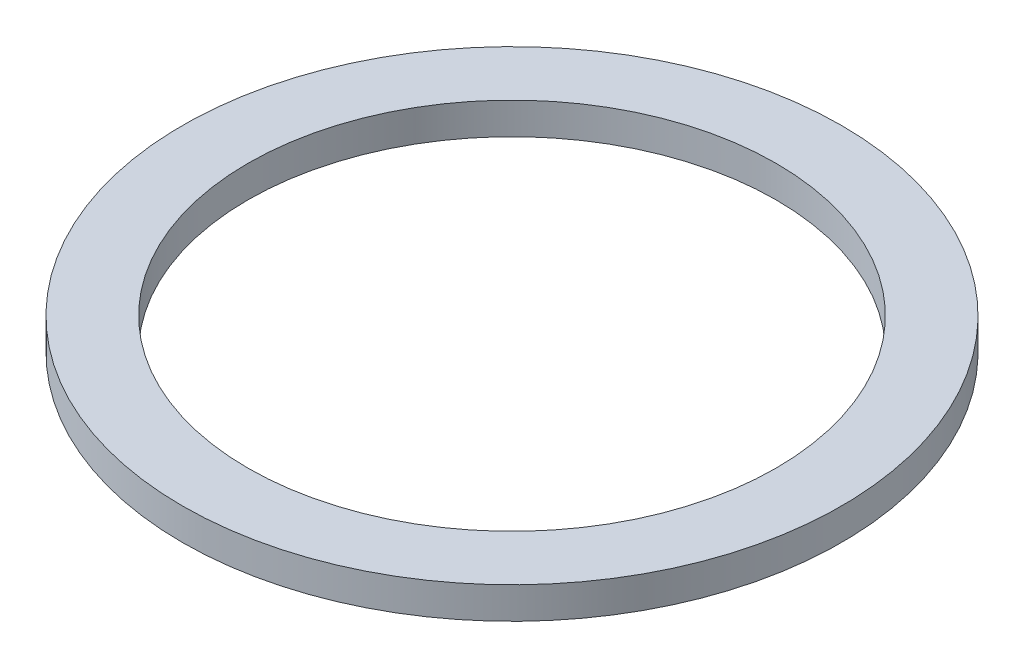
ISO-10303-21;
HEADER;
FILE_DESCRIPTION(('STEP AP214'),'2;1');
FILE_NAME('part.step','',(''),(''),'','','');
FILE_SCHEMA(('AUTOMOTIVE_DESIGN { 1 0 10303 214 1 1 1 1 }'));
ENDSEC;
DATA;
#1=APPLICATION_CONTEXT('core data for automotive mechanical design processes');
#2=APPLICATION_PROTOCOL_DEFINITION('international standard','automotive_design',2000,#1);
#3=PRODUCT_CONTEXT('',#1,'mechanical');
#4=PRODUCT('Part','Part','',(#3));
#5=PRODUCT_RELATED_PRODUCT_CATEGORY('part','',(#4));
#6=PRODUCT_DEFINITION_FORMATION('','',#4);
#7=PRODUCT_DEFINITION_CONTEXT('part definition',#1,'design');
#8=PRODUCT_DEFINITION('design','',#6,#7);
#9=PRODUCT_DEFINITION_SHAPE('','',#8);
#10=(LENGTH_UNIT() NAMED_UNIT(*) SI_UNIT(.MILLI.,.METRE.));
#11=(NAMED_UNIT(*) PLANE_ANGLE_UNIT() SI_UNIT($,.RADIAN.));
#12=(NAMED_UNIT(*) SI_UNIT($,.STERADIAN.) SOLID_ANGLE_UNIT());
#13=UNCERTAINTY_MEASURE_WITH_UNIT(LENGTH_MEASURE(1.E-05),#10,'distance_accuracy_value','');
#14=(GEOMETRIC_REPRESENTATION_CONTEXT(3) GLOBAL_UNCERTAINTY_ASSIGNED_CONTEXT((#13)) GLOBAL_UNIT_ASSIGNED_CONTEXT((#10,
#11,#12)) REPRESENTATION_CONTEXT('',''));
#15=CARTESIAN_POINT('',(0.,0.,0.));
#16=DIRECTION('',(0.,0.,1.));
#17=DIRECTION('',(1.,0.,0.));
#18=AXIS2_PLACEMENT_3D('',#15,#16,#17);
#19=CARTESIAN_POINT('',(0.,4.7625,0.));
#20=DIRECTION('',(0.,1.,0.));
#21=DIRECTION('',(0.,0.,1.));
#22=AXIS2_PLACEMENT_3D('',#19,#20,#21);
#23=PLANE('',#22);
#24=CARTESIAN_POINT('',(0.,4.7625,0.));
#25=DIRECTION('',(0.,1.,0.));
#26=DIRECTION('',(0.,0.,1.));
#27=AXIS2_PLACEMENT_3D('',#24,#25,#26);
#28=CIRCLE('',#27,49.55);
#29=CARTESIAN_POINT('',(0.,4.7625,49.55));
#30=VERTEX_POINT('',#29);
#31=EDGE_CURVE('E11',#30,#30,#28,.T.);
#32=ORIENTED_EDGE('',*,*,#31,.T.);
#33=EDGE_LOOP('',(#32));
#34=FACE_BOUND('',#33,.T.);
#35=CARTESIAN_POINT('',(0.,4.7625,0.));
#36=DIRECTION('',(0.,1.,0.));
#37=DIRECTION('',(0.,0.,1.));
#38=AXIS2_PLACEMENT_3D('',#35,#36,#37);
#39=CIRCLE('',#38,39.7);
#40=CARTESIAN_POINT('',(0.,4.7625,39.7));
#41=VERTEX_POINT('',#40);
#42=EDGE_CURVE('E55',#41,#41,#39,.T.);
#43=ORIENTED_EDGE('',*,*,#42,.F.);
#44=EDGE_LOOP('',(#43));
#45=FACE_BOUND('',#44,.T.);
#46=ADVANCED_FACE('F42',(#34,#45),#23,.T.);
#47=CARTESIAN_POINT('',(0.,0.,0.));
#48=DIRECTION('',(0.,1.,0.));
#49=DIRECTION('',(0.,0.,1.));
#50=AXIS2_PLACEMENT_3D('',#47,#48,#49);
#51=PLANE('',#50);
#52=CARTESIAN_POINT('',(0.,0.,0.));
#53=DIRECTION('',(0.,1.,0.));
#54=DIRECTION('',(0.,0.,1.));
#55=AXIS2_PLACEMENT_3D('',#52,#53,#54);
#56=CIRCLE('',#55,49.55);
#57=CARTESIAN_POINT('',(0.,0.,49.55));
#58=VERTEX_POINT('',#57);
#59=EDGE_CURVE('E46',#58,#58,#56,.T.);
#60=ORIENTED_EDGE('',*,*,#59,.F.);
#61=EDGE_LOOP('',(#60));
#62=FACE_BOUND('',#61,.T.);
#63=CARTESIAN_POINT('',(0.,0.,0.));
#64=DIRECTION('',(0.,1.,0.));
#65=DIRECTION('',(0.,0.,1.));
#66=AXIS2_PLACEMENT_3D('',#63,#64,#65);
#67=CIRCLE('',#66,39.7);
#68=CARTESIAN_POINT('',(0.,0.,39.7));
#69=VERTEX_POINT('',#68);
#70=EDGE_CURVE('E58',#69,#69,#67,.T.);
#71=ORIENTED_EDGE('',*,*,#70,.T.);
#72=EDGE_LOOP('',(#71));
#73=FACE_BOUND('',#72,.T.);
#74=ADVANCED_FACE('F81',(#62,#73),#51,.F.);
#75=CARTESIAN_POINT('',(0.,4.7625,0.));
#76=DIRECTION('',(0.,-1.,0.));
#77=DIRECTION('',(0.,0.,-1.));
#78=AXIS2_PLACEMENT_3D('',#75,#76,#77);
#79=CYLINDRICAL_SURFACE('',#78,49.55);
#80=ORIENTED_EDGE('',*,*,#31,.F.);
#81=EDGE_LOOP('',(#80));
#82=FACE_BOUND('',#81,.T.);
#83=ORIENTED_EDGE('',*,*,#59,.T.);
#84=EDGE_LOOP('',(#83));
#85=FACE_BOUND('',#84,.T.);
#86=ADVANCED_FACE('F44',(#82,#85),#79,.T.);
#87=CARTESIAN_POINT('',(0.,4.7625,0.));
#88=DIRECTION('',(0.,-1.,0.));
#89=DIRECTION('',(0.,0.,-1.));
#90=AXIS2_PLACEMENT_3D('',#87,#88,#89);
#91=CYLINDRICAL_SURFACE('',#90,39.7);
#92=ORIENTED_EDGE('',*,*,#42,.T.);
#93=EDGE_LOOP('',(#92));
#94=FACE_BOUND('',#93,.T.);
#95=ORIENTED_EDGE('',*,*,#70,.F.);
#96=EDGE_LOOP('',(#95));
#97=FACE_BOUND('',#96,.T.);
#98=ADVANCED_FACE('F77',(#94,#97),#91,.F.);
#99=CLOSED_SHELL('',(#46,#74,#86,#98));
#100=MANIFOLD_SOLID_BREP('B2',#99);
#101=ADVANCED_BREP_SHAPE_REPRESENTATION('',(#18,#100),#14);
#102=SHAPE_DEFINITION_REPRESENTATION(#9,#101);
ENDSEC;
END-ISO-10303-21;
